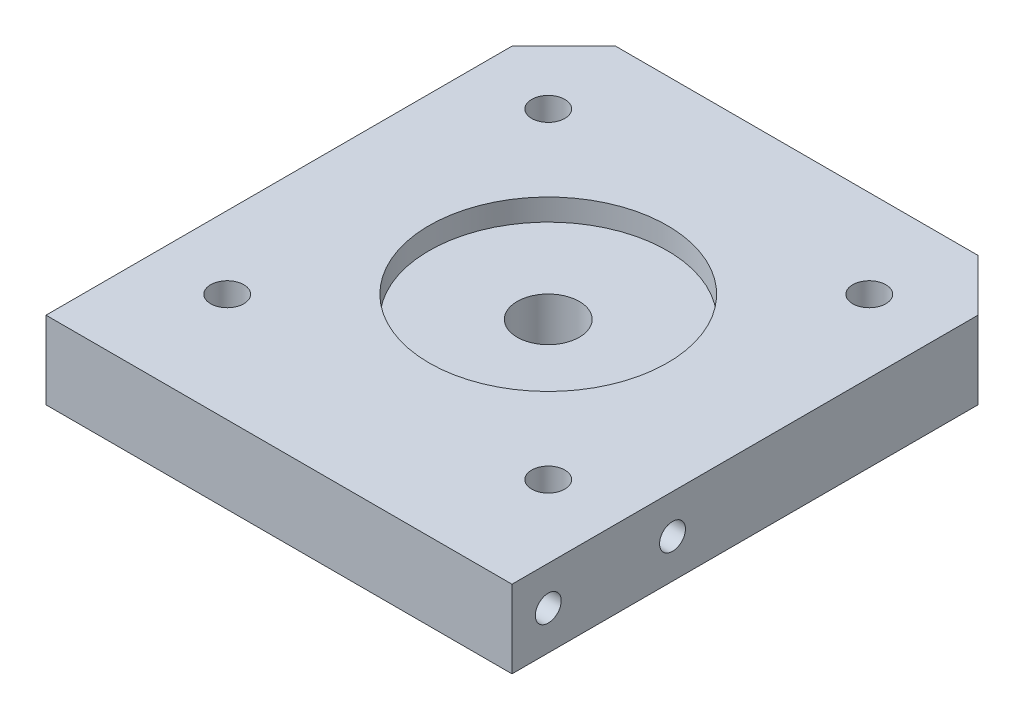
ISO-10303-21;
HEADER;
FILE_DESCRIPTION(('STEP AP214'),'2;1');
FILE_NAME('part.step','',(''),(''),'','','');
FILE_SCHEMA(('AUTOMOTIVE_DESIGN { 1 0 10303 214 1 1 1 1 }'));
ENDSEC;
DATA;
#1=APPLICATION_CONTEXT('core data for automotive mechanical design processes');
#2=APPLICATION_PROTOCOL_DEFINITION('international standard','automotive_design',2000,#1);
#3=PRODUCT_CONTEXT('',#1,'mechanical');
#4=PRODUCT('Part','Part','',(#3));
#5=PRODUCT_RELATED_PRODUCT_CATEGORY('part','',(#4));
#6=PRODUCT_DEFINITION_FORMATION('','',#4);
#7=PRODUCT_DEFINITION_CONTEXT('part definition',#1,'design');
#8=PRODUCT_DEFINITION('design','',#6,#7);
#9=PRODUCT_DEFINITION_SHAPE('','',#8);
#10=(LENGTH_UNIT() NAMED_UNIT(*) SI_UNIT(.MILLI.,.METRE.));
#11=(NAMED_UNIT(*) PLANE_ANGLE_UNIT() SI_UNIT($,.RADIAN.));
#12=(NAMED_UNIT(*) SI_UNIT($,.STERADIAN.) SOLID_ANGLE_UNIT());
#13=UNCERTAINTY_MEASURE_WITH_UNIT(LENGTH_MEASURE(1.E-05),#10,'distance_accuracy_value','');
#14=(GEOMETRIC_REPRESENTATION_CONTEXT(3) GLOBAL_UNCERTAINTY_ASSIGNED_CONTEXT((#13)) GLOBAL_UNIT_ASSIGNED_CONTEXT((#10,
#11,#12)) REPRESENTATION_CONTEXT('',''));
#15=CARTESIAN_POINT('',(0.,0.,0.));
#16=DIRECTION('',(0.,0.,1.));
#17=DIRECTION('',(1.,0.,0.));
#18=AXIS2_PLACEMENT_3D('',#15,#16,#17);
#19=CARTESIAN_POINT('',(0.,7.5,1.5));
#20=DIRECTION('',(0.,-1.,0.));
#21=DIRECTION('',(0.,0.,-1.));
#22=AXIS2_PLACEMENT_3D('',#19,#20,#21);
#23=CYLINDRICAL_SURFACE('',#22,3.);
#24=CARTESIAN_POINT('',(0.,0.,1.5));
#25=DIRECTION('',(0.,1.,0.));
#26=DIRECTION('',(0.,0.,1.));
#27=AXIS2_PLACEMENT_3D('',#24,#25,#26);
#28=CIRCLE('',#27,3.);
#29=CARTESIAN_POINT('',(0.,0.,4.5));
#30=VERTEX_POINT('',#29);
#31=EDGE_CURVE('E207',#30,#30,#28,.T.);
#32=ORIENTED_EDGE('',*,*,#31,.F.);
#33=EDGE_LOOP('',(#32));
#34=FACE_BOUND('',#33,.T.);
#35=CARTESIAN_POINT('',(0.,5.4,1.5));
#36=DIRECTION('',(0.,1.,0.));
#37=DIRECTION('',(0.,0.,1.));
#38=AXIS2_PLACEMENT_3D('',#35,#36,#37);
#39=CIRCLE('',#38,3.);
#40=CARTESIAN_POINT('',(0.,5.4,4.5));
#41=VERTEX_POINT('',#40);
#42=EDGE_CURVE('E204',#41,#41,#39,.T.);
#43=ORIENTED_EDGE('',*,*,#42,.T.);
#44=EDGE_LOOP('',(#43));
#45=FACE_BOUND('',#44,.T.);
#46=ADVANCED_FACE('F42',(#34,#45),#23,.F.);
#47=CARTESIAN_POINT('',(0.,7.5,0.));
#48=DIRECTION('',(0.,-1.,0.));
#49=DIRECTION('',(0.,0.,-1.));
#50=AXIS2_PLACEMENT_3D('',#47,#48,#49);
#51=PLANE('',#50);
#52=CARTESIAN_POINT('',(-15.5,7.5,-14.));
#53=DIRECTION('',(0.,-1.,0.));
#54=DIRECTION('',(0.,0.,-1.));
#55=AXIS2_PLACEMENT_3D('',#52,#53,#54);
#56=CIRCLE('',#55,1.6);
#57=CARTESIAN_POINT('',(-15.5,7.5,-15.6));
#58=VERTEX_POINT('',#57);
#59=EDGE_CURVE('E161',#58,#58,#56,.T.);
#60=ORIENTED_EDGE('',*,*,#59,.T.);
#61=EDGE_LOOP('',(#60));
#62=FACE_BOUND('',#61,.T.);
#63=CARTESIAN_POINT('',(15.5,7.5,17.));
#64=DIRECTION('',(0.,-1.,0.));
#65=DIRECTION('',(0.,0.,-1.));
#66=AXIS2_PLACEMENT_3D('',#63,#64,#65);
#67=CIRCLE('',#66,1.6);
#68=CARTESIAN_POINT('',(15.5,7.5,15.4));
#69=VERTEX_POINT('',#68);
#70=EDGE_CURVE('E173',#69,#69,#67,.T.);
#71=ORIENTED_EDGE('',*,*,#70,.T.);
#72=EDGE_LOOP('',(#71));
#73=FACE_BOUND('',#72,.T.);
#74=CARTESIAN_POINT('',(15.5,7.5,-14.));
#75=DIRECTION('',(0.,-1.,0.));
#76=DIRECTION('',(0.,0.,-1.));
#77=AXIS2_PLACEMENT_3D('',#74,#75,#76);
#78=CIRCLE('',#77,1.6);
#79=CARTESIAN_POINT('',(15.5,7.5,-15.6));
#80=VERTEX_POINT('',#79);
#81=EDGE_CURVE('E185',#80,#80,#78,.T.);
#82=ORIENTED_EDGE('',*,*,#81,.T.);
#83=EDGE_LOOP('',(#82));
#84=FACE_BOUND('',#83,.T.);
#85=CARTESIAN_POINT('',(-15.5,7.5,17.));
#86=DIRECTION('',(0.,-1.,0.));
#87=DIRECTION('',(0.,0.,-1.));
#88=AXIS2_PLACEMENT_3D('',#85,#86,#87);
#89=CIRCLE('',#88,1.6);
#90=CARTESIAN_POINT('',(-15.5,7.5,15.4));
#91=VERTEX_POINT('',#90);
#92=EDGE_CURVE('E197',#91,#91,#89,.T.);
#93=ORIENTED_EDGE('',*,*,#92,.T.);
#94=EDGE_LOOP('',(#93));
#95=FACE_BOUND('',#94,.T.);
#96=CARTESIAN_POINT('',(0.,7.5,1.5));
#97=DIRECTION('',(0.,1.,0.));
#98=DIRECTION('',(0.,0.,1.));
#99=AXIS2_PLACEMENT_3D('',#96,#97,#98);
#100=CIRCLE('',#99,11.5);
#101=CARTESIAN_POINT('',(0.,7.5,13.));
#102=VERTEX_POINT('',#101);
#103=EDGE_CURVE('E200',#102,#102,#100,.T.);
#104=ORIENTED_EDGE('',*,*,#103,.F.);
#105=EDGE_LOOP('',(#104));
#106=FACE_BOUND('',#105,.T.);
#107=DIRECTION('',(0.,0.,-1.));
#108=VECTOR('',#107,1.);
#109=CARTESIAN_POINT('',(22.5,7.5,22.5));
#110=LINE('',#109,#108);
#111=CARTESIAN_POINT('',(22.5,7.5,27.5));
#112=VERTEX_POINT('',#111);
#113=CARTESIAN_POINT('',(22.5,7.5,-17.5));
#114=VERTEX_POINT('',#113);
#115=EDGE_CURVE('E211',#112,#114,#110,.T.);
#116=ORIENTED_EDGE('',*,*,#115,.T.);
#117=DIRECTION('',(0.707106781186547,0.,0.707106781186549));
#118=VECTOR('',#117,1.);
#119=CARTESIAN_POINT('',(17.5,7.5,-22.5));
#120=LINE('',#119,#118);
#121=CARTESIAN_POINT('',(17.5,7.5,-22.5));
#122=VERTEX_POINT('',#121);
#123=EDGE_CURVE('E50',#114,#122,#120,.F.);
#124=ORIENTED_EDGE('',*,*,#123,.T.);
#125=DIRECTION('',(-1.,0.,0.));
#126=VECTOR('',#125,1.);
#127=CARTESIAN_POINT('',(-22.5,7.5,-22.5));
#128=LINE('',#127,#126);
#129=CARTESIAN_POINT('',(-17.5,7.5,-22.5));
#130=VERTEX_POINT('',#129);
#131=EDGE_CURVE('E213',#122,#130,#128,.T.);
#132=ORIENTED_EDGE('',*,*,#131,.T.);
#133=DIRECTION('',(0.707106781186548,0.,-0.707106781186547));
#134=VECTOR('',#133,1.);
#135=CARTESIAN_POINT('',(-22.5,7.5,-17.5));
#136=LINE('',#135,#134);
#137=CARTESIAN_POINT('',(-22.5,7.5,-17.5));
#138=VERTEX_POINT('',#137);
#139=EDGE_CURVE('E57',#130,#138,#136,.F.);
#140=ORIENTED_EDGE('',*,*,#139,.T.);
#141=DIRECTION('',(0.,0.,1.));
#142=VECTOR('',#141,1.);
#143=CARTESIAN_POINT('',(-22.5,7.5,22.5));
#144=LINE('',#143,#142);
#145=CARTESIAN_POINT('',(-22.5,7.5,27.5));
#146=VERTEX_POINT('',#145);
#147=EDGE_CURVE('E216',#138,#146,#144,.T.);
#148=ORIENTED_EDGE('',*,*,#147,.T.);
#149=DIRECTION('',(-1.,0.,0.));
#150=VECTOR('',#149,1.);
#151=CARTESIAN_POINT('',(-22.5,7.5,27.5));
#152=LINE('',#151,#150);
#153=EDGE_CURVE('E149',#112,#146,#152,.T.);
#154=ORIENTED_EDGE('',*,*,#153,.F.);
#155=EDGE_LOOP('',(#116,#124,#132,#140,#148,#154));
#156=FACE_BOUND('',#155,.T.);
#157=ADVANCED_FACE('F237',(#62,#73,#84,#95,#106,#156),#51,.F.);
#158=CARTESIAN_POINT('',(0.,0.,0.));
#159=DIRECTION('',(0.,-1.,0.));
#160=DIRECTION('',(0.,0.,-1.));
#161=AXIS2_PLACEMENT_3D('',#158,#159,#160);
#162=PLANE('',#161);
#163=CARTESIAN_POINT('',(-15.5,0.,-14.));
#164=DIRECTION('',(0.,-1.,0.));
#165=DIRECTION('',(0.,0.,-1.));
#166=AXIS2_PLACEMENT_3D('',#163,#164,#165);
#167=CIRCLE('',#166,3.25);
#168=CARTESIAN_POINT('',(-15.5,0.,-17.25));
#169=VERTEX_POINT('',#168);
#170=EDGE_CURVE('E152',#169,#169,#167,.T.);
#171=ORIENTED_EDGE('',*,*,#170,.F.);
#172=EDGE_LOOP('',(#171));
#173=FACE_BOUND('',#172,.T.);
#174=CARTESIAN_POINT('',(15.5,0.,17.));
#175=DIRECTION('',(0.,-1.,0.));
#176=DIRECTION('',(0.,0.,-1.));
#177=AXIS2_PLACEMENT_3D('',#174,#175,#176);
#178=CIRCLE('',#177,3.25);
#179=CARTESIAN_POINT('',(15.5,0.,13.75));
#180=VERTEX_POINT('',#179);
#181=EDGE_CURVE('E164',#180,#180,#178,.T.);
#182=ORIENTED_EDGE('',*,*,#181,.F.);
#183=EDGE_LOOP('',(#182));
#184=FACE_BOUND('',#183,.T.);
#185=CARTESIAN_POINT('',(15.5,0.,-14.));
#186=DIRECTION('',(0.,-1.,0.));
#187=DIRECTION('',(0.,0.,-1.));
#188=AXIS2_PLACEMENT_3D('',#185,#186,#187);
#189=CIRCLE('',#188,3.25);
#190=CARTESIAN_POINT('',(15.5,0.,-17.25));
#191=VERTEX_POINT('',#190);
#192=EDGE_CURVE('E176',#191,#191,#189,.T.);
#193=ORIENTED_EDGE('',*,*,#192,.F.);
#194=EDGE_LOOP('',(#193));
#195=FACE_BOUND('',#194,.T.);
#196=CARTESIAN_POINT('',(-15.5,0.,17.));
#197=DIRECTION('',(0.,-1.,0.));
#198=DIRECTION('',(0.,0.,-1.));
#199=AXIS2_PLACEMENT_3D('',#196,#197,#198);
#200=CIRCLE('',#199,3.25);
#201=CARTESIAN_POINT('',(-15.5,0.,13.75));
#202=VERTEX_POINT('',#201);
#203=EDGE_CURVE('E188',#202,#202,#200,.T.);
#204=ORIENTED_EDGE('',*,*,#203,.F.);
#205=EDGE_LOOP('',(#204));
#206=FACE_BOUND('',#205,.T.);
#207=DIRECTION('',(-1.,0.,0.));
#208=VECTOR('',#207,1.);
#209=CARTESIAN_POINT('',(-22.5,0.,-22.5));
#210=LINE('',#209,#208);
#211=CARTESIAN_POINT('',(17.5,0.,-22.5));
#212=VERTEX_POINT('',#211);
#213=CARTESIAN_POINT('',(-17.5,0.,-22.5));
#214=VERTEX_POINT('',#213);
#215=EDGE_CURVE('E220',#212,#214,#210,.T.);
#216=ORIENTED_EDGE('',*,*,#215,.F.);
#217=DIRECTION('',(-0.707106781186547,0.,-0.707106781186549));
#218=VECTOR('',#217,1.);
#219=CARTESIAN_POINT('',(20.,0.,-20.));
#220=LINE('',#219,#218);
#221=CARTESIAN_POINT('',(22.5,0.,-17.5));
#222=VERTEX_POINT('',#221);
#223=EDGE_CURVE('E232',#212,#222,#220,.F.);
#224=ORIENTED_EDGE('',*,*,#223,.T.);
#225=DIRECTION('',(0.,0.,-1.));
#226=VECTOR('',#225,1.);
#227=CARTESIAN_POINT('',(22.5,0.,22.5));
#228=LINE('',#227,#226);
#229=CARTESIAN_POINT('',(22.5,0.,27.5));
#230=VERTEX_POINT('',#229);
#231=EDGE_CURVE('E210',#230,#222,#228,.T.);
#232=ORIENTED_EDGE('',*,*,#231,.F.);
#233=DIRECTION('',(1.,0.,0.));
#234=VECTOR('',#233,1.);
#235=CARTESIAN_POINT('',(-22.5,0.,27.5));
#236=LINE('',#235,#234);
#237=CARTESIAN_POINT('',(-22.5,0.,27.5));
#238=VERTEX_POINT('',#237);
#239=EDGE_CURVE('E143',#238,#230,#236,.T.);
#240=ORIENTED_EDGE('',*,*,#239,.F.);
#241=DIRECTION('',(0.,0.,1.));
#242=VECTOR('',#241,1.);
#243=CARTESIAN_POINT('',(-22.5,0.,22.5));
#244=LINE('',#243,#242);
#245=CARTESIAN_POINT('',(-22.5,0.,-17.5));
#246=VERTEX_POINT('',#245);
#247=EDGE_CURVE('E214',#246,#238,#244,.T.);
#248=ORIENTED_EDGE('',*,*,#247,.F.);
#249=DIRECTION('',(-0.707106781186548,0.,0.707106781186547));
#250=VECTOR('',#249,1.);
#251=CARTESIAN_POINT('',(-20.,0.,-20.));
#252=LINE('',#251,#250);
#253=EDGE_CURVE('E230',#246,#214,#252,.F.);
#254=ORIENTED_EDGE('',*,*,#253,.T.);
#255=EDGE_LOOP('',(#216,#224,#232,#240,#248,#254));
#256=FACE_BOUND('',#255,.T.);
#257=ORIENTED_EDGE('',*,*,#31,.T.);
#258=EDGE_LOOP('',(#257));
#259=FACE_BOUND('',#258,.T.);
#260=ADVANCED_FACE('F247',(#173,#184,#195,#206,#256,#259),#162,.T.);
#261=CARTESIAN_POINT('',(22.5,7.5,22.5));
#262=DIRECTION('',(-1.,0.,0.));
#263=DIRECTION('',(0.,0.,1.));
#264=AXIS2_PLACEMENT_3D('',#261,#262,#263);
#265=PLANE('',#264);
#266=CARTESIAN_POINT('',(22.5,3.75,24.));
#267=DIRECTION('',(1.,0.,0.));
#268=DIRECTION('',(0.,0.,-1.));
#269=AXIS2_PLACEMENT_3D('',#266,#267,#268);
#270=CIRCLE('',#269,1.24999999999999);
#271=CARTESIAN_POINT('',(22.5,3.75,22.75));
#272=VERTEX_POINT('',#271);
#273=EDGE_CURVE('E118',#272,#272,#270,.T.);
#274=ORIENTED_EDGE('',*,*,#273,.F.);
#275=EDGE_LOOP('',(#274));
#276=FACE_BOUND('',#275,.T.);
#277=CARTESIAN_POINT('',(22.5,3.75,12.));
#278=DIRECTION('',(1.,0.,0.));
#279=DIRECTION('',(0.,0.,-1.));
#280=AXIS2_PLACEMENT_3D('',#277,#278,#279);
#281=CIRCLE('',#280,1.24999999999999);
#282=CARTESIAN_POINT('',(22.5,3.75,10.75));
#283=VERTEX_POINT('',#282);
#284=EDGE_CURVE('E117',#283,#283,#281,.T.);
#285=ORIENTED_EDGE('',*,*,#284,.F.);
#286=EDGE_LOOP('',(#285));
#287=FACE_BOUND('',#286,.T.);
#288=ORIENTED_EDGE('',*,*,#231,.T.);
#289=DIRECTION('',(0.,1.,0.));
#290=VECTOR('',#289,1.);
#291=CARTESIAN_POINT('',(22.5,7.5,-17.5));
#292=LINE('',#291,#290);
#293=EDGE_CURVE('E65',#222,#114,#292,.T.);
#294=ORIENTED_EDGE('',*,*,#293,.T.);
#295=ORIENTED_EDGE('',*,*,#115,.F.);
#296=DIRECTION('',(0.,1.,0.));
#297=VECTOR('',#296,1.);
#298=CARTESIAN_POINT('',(22.5,7.5,27.5));
#299=LINE('',#298,#297);
#300=EDGE_CURVE('E146',#230,#112,#299,.T.);
#301=ORIENTED_EDGE('',*,*,#300,.F.);
#302=EDGE_LOOP('',(#288,#294,#295,#301));
#303=FACE_BOUND('',#302,.T.);
#304=ADVANCED_FACE('F251',(#276,#287,#303),#265,.F.);
#305=CARTESIAN_POINT('',(-22.5,7.5,-22.5));
#306=DIRECTION('',(0.,0.,1.));
#307=DIRECTION('',(1.,0.,0.));
#308=AXIS2_PLACEMENT_3D('',#305,#306,#307);
#309=PLANE('',#308);
#310=ORIENTED_EDGE('',*,*,#131,.F.);
#311=DIRECTION('',(0.,-1.,0.));
#312=VECTOR('',#311,1.);
#313=CARTESIAN_POINT('',(17.5,7.5,-22.5));
#314=LINE('',#313,#312);
#315=EDGE_CURVE('E227',#122,#212,#314,.T.);
#316=ORIENTED_EDGE('',*,*,#315,.T.);
#317=ORIENTED_EDGE('',*,*,#215,.T.);
#318=DIRECTION('',(0.,1.,0.));
#319=VECTOR('',#318,1.);
#320=CARTESIAN_POINT('',(-17.5,7.5,-22.5));
#321=LINE('',#320,#319);
#322=EDGE_CURVE('E218',#214,#130,#321,.T.);
#323=ORIENTED_EDGE('',*,*,#322,.T.);
#324=EDGE_LOOP('',(#310,#316,#317,#323));
#325=FACE_BOUND('',#324,.T.);
#326=ADVANCED_FACE('F242',(#325),#309,.F.);
#327=CARTESIAN_POINT('',(-22.5,7.5,22.5));
#328=DIRECTION('',(1.,0.,0.));
#329=DIRECTION('',(0.,0.,-1.));
#330=AXIS2_PLACEMENT_3D('',#327,#328,#329);
#331=PLANE('',#330);
#332=CARTESIAN_POINT('',(-22.5,3.75,24.));
#333=DIRECTION('',(-1.,0.,0.));
#334=DIRECTION('',(0.,0.,1.));
#335=AXIS2_PLACEMENT_3D('',#332,#333,#334);
#336=CIRCLE('',#335,1.24999999999999);
#337=CARTESIAN_POINT('',(-22.5,3.75,25.25));
#338=VERTEX_POINT('',#337);
#339=EDGE_CURVE('E128',#338,#338,#336,.T.);
#340=ORIENTED_EDGE('',*,*,#339,.F.);
#341=EDGE_LOOP('',(#340));
#342=FACE_BOUND('',#341,.T.);
#343=CARTESIAN_POINT('',(-22.5,3.75,12.));
#344=DIRECTION('',(-1.,0.,0.));
#345=DIRECTION('',(0.,0.,1.));
#346=AXIS2_PLACEMENT_3D('',#343,#344,#345);
#347=CIRCLE('',#346,1.24999999999999);
#348=CARTESIAN_POINT('',(-22.5,3.75,13.25));
#349=VERTEX_POINT('',#348);
#350=EDGE_CURVE('E134',#349,#349,#347,.T.);
#351=ORIENTED_EDGE('',*,*,#350,.F.);
#352=EDGE_LOOP('',(#351));
#353=FACE_BOUND('',#352,.T.);
#354=ORIENTED_EDGE('',*,*,#147,.F.);
#355=DIRECTION('',(0.,-1.,0.));
#356=VECTOR('',#355,1.);
#357=CARTESIAN_POINT('',(-22.5,7.5,-17.5));
#358=LINE('',#357,#356);
#359=EDGE_CURVE('E11',#138,#246,#358,.T.);
#360=ORIENTED_EDGE('',*,*,#359,.T.);
#361=ORIENTED_EDGE('',*,*,#247,.T.);
#362=DIRECTION('',(0.,-1.,0.));
#363=VECTOR('',#362,1.);
#364=CARTESIAN_POINT('',(-22.5,7.5,27.5));
#365=LINE('',#364,#363);
#366=EDGE_CURVE('E140',#146,#238,#365,.T.);
#367=ORIENTED_EDGE('',*,*,#366,.F.);
#368=EDGE_LOOP('',(#354,#360,#361,#367));
#369=FACE_BOUND('',#368,.T.);
#370=ADVANCED_FACE('F257',(#342,#353,#369),#331,.F.);
#371=CARTESIAN_POINT('',(0.,5.4,1.5));
#372=DIRECTION('',(0.,1.,0.));
#373=DIRECTION('',(0.,0.,1.));
#374=AXIS2_PLACEMENT_3D('',#371,#372,#373);
#375=CYLINDRICAL_SURFACE('',#374,11.5);
#376=CARTESIAN_POINT('',(0.,5.4,1.5));
#377=DIRECTION('',(0.,1.,0.));
#378=DIRECTION('',(0.,0.,1.));
#379=AXIS2_PLACEMENT_3D('',#376,#377,#378);
#380=CIRCLE('',#379,11.5);
#381=CARTESIAN_POINT('',(0.,5.4,13.));
#382=VERTEX_POINT('',#381);
#383=EDGE_CURVE('E201',#382,#382,#380,.T.);
#384=ORIENTED_EDGE('',*,*,#383,.F.);
#385=EDGE_LOOP('',(#384));
#386=FACE_BOUND('',#385,.T.);
#387=ORIENTED_EDGE('',*,*,#103,.T.);
#388=EDGE_LOOP('',(#387));
#389=FACE_BOUND('',#388,.T.);
#390=ADVANCED_FACE('F281',(#386,#389),#375,.F.);
#391=CARTESIAN_POINT('',(0.,5.4,1.5));
#392=DIRECTION('',(0.,1.,0.));
#393=DIRECTION('',(0.,0.,1.));
#394=AXIS2_PLACEMENT_3D('',#391,#392,#393);
#395=PLANE('',#394);
#396=ORIENTED_EDGE('',*,*,#42,.F.);
#397=EDGE_LOOP('',(#396));
#398=FACE_BOUND('',#397,.T.);
#399=ORIENTED_EDGE('',*,*,#383,.T.);
#400=EDGE_LOOP('',(#399));
#401=FACE_BOUND('',#400,.T.);
#402=ADVANCED_FACE('F269',(#398,#401),#395,.T.);
#403=CARTESIAN_POINT('',(17.5,7.5,-22.5));
#404=DIRECTION('',(-0.707106781186549,0.,0.707106781186547));
#405=DIRECTION('',(0.,-1.,0.));
#406=AXIS2_PLACEMENT_3D('',#403,#404,#405);
#407=PLANE('',#406);
#408=ORIENTED_EDGE('',*,*,#123,.F.);
#409=ORIENTED_EDGE('',*,*,#293,.F.);
#410=ORIENTED_EDGE('',*,*,#223,.F.);
#411=ORIENTED_EDGE('',*,*,#315,.F.);
#412=EDGE_LOOP('',(#408,#409,#410,#411));
#413=FACE_BOUND('',#412,.T.);
#414=ADVANCED_FACE('F245',(#413),#407,.F.);
#415=CARTESIAN_POINT('',(-22.5,7.5,-17.5));
#416=DIRECTION('',(0.707106781186547,0.,0.707106781186548));
#417=DIRECTION('',(0.,-1.,0.));
#418=AXIS2_PLACEMENT_3D('',#415,#416,#417);
#419=PLANE('',#418);
#420=ORIENTED_EDGE('',*,*,#139,.F.);
#421=ORIENTED_EDGE('',*,*,#322,.F.);
#422=ORIENTED_EDGE('',*,*,#253,.F.);
#423=ORIENTED_EDGE('',*,*,#359,.F.);
#424=EDGE_LOOP('',(#420,#421,#422,#423));
#425=FACE_BOUND('',#424,.T.);
#426=ADVANCED_FACE('F44',(#425),#419,.F.);
#427=CARTESIAN_POINT('',(-15.5,0.,17.));
#428=DIRECTION('',(0.,-1.,0.));
#429=DIRECTION('',(0.,0.,-1.));
#430=AXIS2_PLACEMENT_3D('',#427,#428,#429);
#431=CYLINDRICAL_SURFACE('',#430,1.6);
#432=ORIENTED_EDGE('',*,*,#92,.F.);
#433=EDGE_LOOP('',(#432));
#434=FACE_BOUND('',#433,.T.);
#435=CARTESIAN_POINT('',(-15.5,3.5,17.));
#436=DIRECTION('',(0.,-1.,0.));
#437=DIRECTION('',(0.,0.,-1.));
#438=AXIS2_PLACEMENT_3D('',#435,#436,#437);
#439=CIRCLE('',#438,1.6);
#440=CARTESIAN_POINT('',(-15.5,3.5,15.4));
#441=VERTEX_POINT('',#440);
#442=EDGE_CURVE('E194',#441,#441,#439,.T.);
#443=ORIENTED_EDGE('',*,*,#442,.T.);
#444=EDGE_LOOP('',(#443));
#445=FACE_BOUND('',#444,.T.);
#446=ADVANCED_FACE('F261',(#434,#445),#431,.F.);
#447=CARTESIAN_POINT('',(-13.9,3.5,17.));
#448=DIRECTION('',(0.,1.,0.));
#449=DIRECTION('',(0.,0.,1.));
#450=AXIS2_PLACEMENT_3D('',#447,#448,#449);
#451=PLANE('',#450);
#452=ORIENTED_EDGE('',*,*,#442,.F.);
#453=EDGE_LOOP('',(#452));
#454=FACE_BOUND('',#453,.T.);
#455=CARTESIAN_POINT('',(-15.5,3.5,17.));
#456=DIRECTION('',(0.,-1.,0.));
#457=DIRECTION('',(0.,0.,-1.));
#458=AXIS2_PLACEMENT_3D('',#455,#456,#457);
#459=CIRCLE('',#458,3.25);
#460=CARTESIAN_POINT('',(-15.5,3.5,13.75));
#461=VERTEX_POINT('',#460);
#462=EDGE_CURVE('E191',#461,#461,#459,.T.);
#463=ORIENTED_EDGE('',*,*,#462,.T.);
#464=EDGE_LOOP('',(#463));
#465=FACE_BOUND('',#464,.T.);
#466=ADVANCED_FACE('F266',(#454,#465),#451,.F.);
#467=CARTESIAN_POINT('',(-15.5,0.,17.));
#468=DIRECTION('',(0.,-1.,0.));
#469=DIRECTION('',(0.,0.,-1.));
#470=AXIS2_PLACEMENT_3D('',#467,#468,#469);
#471=CYLINDRICAL_SURFACE('',#470,3.25);
#472=ORIENTED_EDGE('',*,*,#462,.F.);
#473=EDGE_LOOP('',(#472));
#474=FACE_BOUND('',#473,.T.);
#475=ORIENTED_EDGE('',*,*,#203,.T.);
#476=EDGE_LOOP('',(#475));
#477=FACE_BOUND('',#476,.T.);
#478=ADVANCED_FACE('F365',(#474,#477),#471,.F.);
#479=CARTESIAN_POINT('',(15.5,0.,-14.));
#480=DIRECTION('',(0.,-1.,0.));
#481=DIRECTION('',(0.,0.,-1.));
#482=AXIS2_PLACEMENT_3D('',#479,#480,#481);
#483=CYLINDRICAL_SURFACE('',#482,1.6);
#484=ORIENTED_EDGE('',*,*,#81,.F.);
#485=EDGE_LOOP('',(#484));
#486=FACE_BOUND('',#485,.T.);
#487=CARTESIAN_POINT('',(15.5,3.5,-14.));
#488=DIRECTION('',(0.,-1.,0.));
#489=DIRECTION('',(0.,0.,-1.));
#490=AXIS2_PLACEMENT_3D('',#487,#488,#489);
#491=CIRCLE('',#490,1.6);
#492=CARTESIAN_POINT('',(15.5,3.5,-15.6));
#493=VERTEX_POINT('',#492);
#494=EDGE_CURVE('E182',#493,#493,#491,.T.);
#495=ORIENTED_EDGE('',*,*,#494,.T.);
#496=EDGE_LOOP('',(#495));
#497=FACE_BOUND('',#496,.T.);
#498=ADVANCED_FACE('F361',(#486,#497),#483,.F.);
#499=CARTESIAN_POINT('',(17.1,3.5,-14.));
#500=DIRECTION('',(0.,1.,0.));
#501=DIRECTION('',(0.,0.,1.));
#502=AXIS2_PLACEMENT_3D('',#499,#500,#501);
#503=PLANE('',#502);
#504=ORIENTED_EDGE('',*,*,#494,.F.);
#505=EDGE_LOOP('',(#504));
#506=FACE_BOUND('',#505,.T.);
#507=CARTESIAN_POINT('',(15.5,3.5,-14.));
#508=DIRECTION('',(0.,-1.,0.));
#509=DIRECTION('',(0.,0.,-1.));
#510=AXIS2_PLACEMENT_3D('',#507,#508,#509);
#511=CIRCLE('',#510,3.25);
#512=CARTESIAN_POINT('',(15.5,3.5,-17.25));
#513=VERTEX_POINT('',#512);
#514=EDGE_CURVE('E179',#513,#513,#511,.T.);
#515=ORIENTED_EDGE('',*,*,#514,.T.);
#516=EDGE_LOOP('',(#515));
#517=FACE_BOUND('',#516,.T.);
#518=ADVANCED_FACE('F357',(#506,#517),#503,.F.);
#519=CARTESIAN_POINT('',(15.5,0.,-14.));
#520=DIRECTION('',(0.,-1.,0.));
#521=DIRECTION('',(0.,0.,-1.));
#522=AXIS2_PLACEMENT_3D('',#519,#520,#521);
#523=CYLINDRICAL_SURFACE('',#522,3.25);
#524=ORIENTED_EDGE('',*,*,#514,.F.);
#525=EDGE_LOOP('',(#524));
#526=FACE_BOUND('',#525,.T.);
#527=ORIENTED_EDGE('',*,*,#192,.T.);
#528=EDGE_LOOP('',(#527));
#529=FACE_BOUND('',#528,.T.);
#530=ADVANCED_FACE('F353',(#526,#529),#523,.F.);
#531=CARTESIAN_POINT('',(15.5,0.,17.));
#532=DIRECTION('',(0.,-1.,0.));
#533=DIRECTION('',(0.,0.,-1.));
#534=AXIS2_PLACEMENT_3D('',#531,#532,#533);
#535=CYLINDRICAL_SURFACE('',#534,1.6);
#536=ORIENTED_EDGE('',*,*,#70,.F.);
#537=EDGE_LOOP('',(#536));
#538=FACE_BOUND('',#537,.T.);
#539=CARTESIAN_POINT('',(15.5,3.5,17.));
#540=DIRECTION('',(0.,-1.,0.));
#541=DIRECTION('',(0.,0.,-1.));
#542=AXIS2_PLACEMENT_3D('',#539,#540,#541);
#543=CIRCLE('',#542,1.6);
#544=CARTESIAN_POINT('',(15.5,3.5,15.4));
#545=VERTEX_POINT('',#544);
#546=EDGE_CURVE('E170',#545,#545,#543,.T.);
#547=ORIENTED_EDGE('',*,*,#546,.T.);
#548=EDGE_LOOP('',(#547));
#549=FACE_BOUND('',#548,.T.);
#550=ADVANCED_FACE('F349',(#538,#549),#535,.F.);
#551=CARTESIAN_POINT('',(17.1,3.5,17.));
#552=DIRECTION('',(0.,1.,0.));
#553=DIRECTION('',(0.,0.,1.));
#554=AXIS2_PLACEMENT_3D('',#551,#552,#553);
#555=PLANE('',#554);
#556=ORIENTED_EDGE('',*,*,#546,.F.);
#557=EDGE_LOOP('',(#556));
#558=FACE_BOUND('',#557,.T.);
#559=CARTESIAN_POINT('',(15.5,3.5,17.));
#560=DIRECTION('',(0.,-1.,0.));
#561=DIRECTION('',(0.,0.,-1.));
#562=AXIS2_PLACEMENT_3D('',#559,#560,#561);
#563=CIRCLE('',#562,3.25);
#564=CARTESIAN_POINT('',(15.5,3.5,13.75));
#565=VERTEX_POINT('',#564);
#566=EDGE_CURVE('E167',#565,#565,#563,.T.);
#567=ORIENTED_EDGE('',*,*,#566,.T.);
#568=EDGE_LOOP('',(#567));
#569=FACE_BOUND('',#568,.T.);
#570=ADVANCED_FACE('F345',(#558,#569),#555,.F.);
#571=CARTESIAN_POINT('',(15.5,0.,17.));
#572=DIRECTION('',(0.,-1.,0.));
#573=DIRECTION('',(0.,0.,-1.));
#574=AXIS2_PLACEMENT_3D('',#571,#572,#573);
#575=CYLINDRICAL_SURFACE('',#574,3.25);
#576=ORIENTED_EDGE('',*,*,#566,.F.);
#577=EDGE_LOOP('',(#576));
#578=FACE_BOUND('',#577,.T.);
#579=ORIENTED_EDGE('',*,*,#181,.T.);
#580=EDGE_LOOP('',(#579));
#581=FACE_BOUND('',#580,.T.);
#582=ADVANCED_FACE('F341',(#578,#581),#575,.F.);
#583=CARTESIAN_POINT('',(-15.5,0.,-14.));
#584=DIRECTION('',(0.,-1.,0.));
#585=DIRECTION('',(0.,0.,-1.));
#586=AXIS2_PLACEMENT_3D('',#583,#584,#585);
#587=CYLINDRICAL_SURFACE('',#586,1.6);
#588=ORIENTED_EDGE('',*,*,#59,.F.);
#589=EDGE_LOOP('',(#588));
#590=FACE_BOUND('',#589,.T.);
#591=CARTESIAN_POINT('',(-15.5,3.5,-14.));
#592=DIRECTION('',(0.,-1.,0.));
#593=DIRECTION('',(0.,0.,-1.));
#594=AXIS2_PLACEMENT_3D('',#591,#592,#593);
#595=CIRCLE('',#594,1.6);
#596=CARTESIAN_POINT('',(-15.5,3.5,-15.6));
#597=VERTEX_POINT('',#596);
#598=EDGE_CURVE('E158',#597,#597,#595,.T.);
#599=ORIENTED_EDGE('',*,*,#598,.T.);
#600=EDGE_LOOP('',(#599));
#601=FACE_BOUND('',#600,.T.);
#602=ADVANCED_FACE('F337',(#590,#601),#587,.F.);
#603=CARTESIAN_POINT('',(-13.9,3.5,-14.));
#604=DIRECTION('',(0.,1.,0.));
#605=DIRECTION('',(0.,0.,1.));
#606=AXIS2_PLACEMENT_3D('',#603,#604,#605);
#607=PLANE('',#606);
#608=ORIENTED_EDGE('',*,*,#598,.F.);
#609=EDGE_LOOP('',(#608));
#610=FACE_BOUND('',#609,.T.);
#611=CARTESIAN_POINT('',(-15.5,3.5,-14.));
#612=DIRECTION('',(0.,-1.,0.));
#613=DIRECTION('',(0.,0.,-1.));
#614=AXIS2_PLACEMENT_3D('',#611,#612,#613);
#615=CIRCLE('',#614,3.25);
#616=CARTESIAN_POINT('',(-15.5,3.5,-17.25));
#617=VERTEX_POINT('',#616);
#618=EDGE_CURVE('E155',#617,#617,#615,.T.);
#619=ORIENTED_EDGE('',*,*,#618,.T.);
#620=EDGE_LOOP('',(#619));
#621=FACE_BOUND('',#620,.T.);
#622=ADVANCED_FACE('F333',(#610,#621),#607,.F.);
#623=CARTESIAN_POINT('',(-15.5,0.,-14.));
#624=DIRECTION('',(0.,-1.,0.));
#625=DIRECTION('',(0.,0.,-1.));
#626=AXIS2_PLACEMENT_3D('',#623,#624,#625);
#627=CYLINDRICAL_SURFACE('',#626,3.25);
#628=ORIENTED_EDGE('',*,*,#618,.F.);
#629=EDGE_LOOP('',(#628));
#630=FACE_BOUND('',#629,.T.);
#631=ORIENTED_EDGE('',*,*,#170,.T.);
#632=EDGE_LOOP('',(#631));
#633=FACE_BOUND('',#632,.T.);
#634=ADVANCED_FACE('F330',(#630,#633),#627,.F.);
#635=CARTESIAN_POINT('',(0.,0.,27.5));
#636=DIRECTION('',(0.,0.,1.));
#637=DIRECTION('',(1.,0.,0.));
#638=AXIS2_PLACEMENT_3D('',#635,#636,#637);
#639=PLANE('',#638);
#640=ORIENTED_EDGE('',*,*,#366,.T.);
#641=ORIENTED_EDGE('',*,*,#239,.T.);
#642=ORIENTED_EDGE('',*,*,#300,.T.);
#643=ORIENTED_EDGE('',*,*,#153,.T.);
#644=EDGE_LOOP('',(#640,#641,#642,#643));
#645=FACE_BOUND('',#644,.T.);
#646=ADVANCED_FACE('F253',(#645),#639,.T.);
#647=CARTESIAN_POINT('',(-12.5,3.75,12.));
#648=DIRECTION('',(-1.,0.,0.));
#649=DIRECTION('',(0.,0.,1.));
#650=AXIS2_PLACEMENT_3D('',#647,#648,#649);
#651=CONICAL_SURFACE('',#650,1.25,1.02974425867665);
#652=CARTESIAN_POINT('',(-11.7489242262155,3.75,12.));
#653=VERTEX_POINT('',#652);
#654=VERTEX_LOOP('',#653);
#655=FACE_BOUND('',#654,.T.);
#656=CARTESIAN_POINT('',(-12.5,3.75,12.));
#657=DIRECTION('',(-1.,0.,0.));
#658=DIRECTION('',(0.,0.,1.));
#659=AXIS2_PLACEMENT_3D('',#656,#657,#658);
#660=CIRCLE('',#659,1.25);
#661=CARTESIAN_POINT('',(-12.5,3.75,13.25));
#662=VERTEX_POINT('',#661);
#663=EDGE_CURVE('E137',#662,#662,#660,.T.);
#664=ORIENTED_EDGE('',*,*,#663,.T.);
#665=EDGE_LOOP('',(#664));
#666=FACE_BOUND('',#665,.T.);
#667=ADVANCED_FACE('F323',(#655,#666),#651,.F.);
#668=CARTESIAN_POINT('',(-22.5,3.75,12.));
#669=DIRECTION('',(-1.,0.,0.));
#670=DIRECTION('',(0.,0.,1.));
#671=AXIS2_PLACEMENT_3D('',#668,#669,#670);
#672=CYLINDRICAL_SURFACE('',#671,1.24999999999999);
#673=ORIENTED_EDGE('',*,*,#663,.F.);
#674=EDGE_LOOP('',(#673));
#675=FACE_BOUND('',#674,.T.);
#676=ORIENTED_EDGE('',*,*,#350,.T.);
#677=EDGE_LOOP('',(#676));
#678=FACE_BOUND('',#677,.T.);
#679=ADVANCED_FACE('F319',(#675,#678),#672,.F.);
#680=CARTESIAN_POINT('',(-12.5,3.75,24.));
#681=DIRECTION('',(-1.,0.,0.));
#682=DIRECTION('',(0.,0.,1.));
#683=AXIS2_PLACEMENT_3D('',#680,#681,#682);
#684=CONICAL_SURFACE('',#683,1.25,1.02974425867665);
#685=CARTESIAN_POINT('',(-11.7489242262155,3.75,24.));
#686=VERTEX_POINT('',#685);
#687=VERTEX_LOOP('',#686);
#688=FACE_BOUND('',#687,.T.);
#689=CARTESIAN_POINT('',(-12.5,3.75,24.));
#690=DIRECTION('',(-1.,0.,0.));
#691=DIRECTION('',(0.,0.,1.));
#692=AXIS2_PLACEMENT_3D('',#689,#690,#691);
#693=CIRCLE('',#692,1.25);
#694=CARTESIAN_POINT('',(-12.5,3.75,25.25));
#695=VERTEX_POINT('',#694);
#696=EDGE_CURVE('E131',#695,#695,#693,.T.);
#697=ORIENTED_EDGE('',*,*,#696,.T.);
#698=EDGE_LOOP('',(#697));
#699=FACE_BOUND('',#698,.T.);
#700=ADVANCED_FACE('F315',(#688,#699),#684,.F.);
#701=CARTESIAN_POINT('',(-22.5,3.75,24.));
#702=DIRECTION('',(-1.,0.,0.));
#703=DIRECTION('',(0.,0.,1.));
#704=AXIS2_PLACEMENT_3D('',#701,#702,#703);
#705=CYLINDRICAL_SURFACE('',#704,1.24999999999999);
#706=ORIENTED_EDGE('',*,*,#696,.F.);
#707=EDGE_LOOP('',(#706));
#708=FACE_BOUND('',#707,.T.);
#709=ORIENTED_EDGE('',*,*,#339,.T.);
#710=EDGE_LOOP('',(#709));
#711=FACE_BOUND('',#710,.T.);
#712=ADVANCED_FACE('F307',(#708,#711),#705,.F.);
#713=CARTESIAN_POINT('',(12.5,3.75,12.));
#714=DIRECTION('',(1.,0.,0.));
#715=DIRECTION('',(0.,0.,-1.));
#716=AXIS2_PLACEMENT_3D('',#713,#714,#715);
#717=CONICAL_SURFACE('',#716,1.25,1.02974425867665);
#718=CARTESIAN_POINT('',(11.7489242262155,3.75,12.));
#719=VERTEX_POINT('',#718);
#720=VERTEX_LOOP('',#719);
#721=FACE_BOUND('',#720,.T.);
#722=CARTESIAN_POINT('',(12.5,3.75,12.));
#723=DIRECTION('',(1.,0.,0.));
#724=DIRECTION('',(0.,0.,-1.));
#725=AXIS2_PLACEMENT_3D('',#722,#723,#724);
#726=CIRCLE('',#725,1.25);
#727=CARTESIAN_POINT('',(12.5,3.75,10.75));
#728=VERTEX_POINT('',#727);
#729=EDGE_CURVE('E121',#728,#728,#726,.T.);
#730=ORIENTED_EDGE('',*,*,#729,.T.);
#731=EDGE_LOOP('',(#730));
#732=FACE_BOUND('',#731,.T.);
#733=ADVANCED_FACE('F301',(#721,#732),#717,.F.);
#734=CARTESIAN_POINT('',(22.5,3.75,12.));
#735=DIRECTION('',(1.,0.,0.));
#736=DIRECTION('',(0.,0.,-1.));
#737=AXIS2_PLACEMENT_3D('',#734,#735,#736);
#738=CYLINDRICAL_SURFACE('',#737,1.24999999999999);
#739=ORIENTED_EDGE('',*,*,#729,.F.);
#740=EDGE_LOOP('',(#739));
#741=FACE_BOUND('',#740,.T.);
#742=ORIENTED_EDGE('',*,*,#284,.T.);
#743=EDGE_LOOP('',(#742));
#744=FACE_BOUND('',#743,.T.);
#745=ADVANCED_FACE('F111',(#741,#744),#738,.F.);
#746=CARTESIAN_POINT('',(12.5,3.75,24.));
#747=DIRECTION('',(1.,0.,0.));
#748=DIRECTION('',(0.,0.,-1.));
#749=AXIS2_PLACEMENT_3D('',#746,#747,#748);
#750=CONICAL_SURFACE('',#749,1.25,1.02974425867665);
#751=CARTESIAN_POINT('',(11.7489242262155,3.75,24.));
#752=VERTEX_POINT('',#751);
#753=VERTEX_LOOP('',#752);
#754=FACE_BOUND('',#753,.T.);
#755=CARTESIAN_POINT('',(12.5,3.75,24.));
#756=DIRECTION('',(1.,0.,0.));
#757=DIRECTION('',(0.,0.,-1.));
#758=AXIS2_PLACEMENT_3D('',#755,#756,#757);
#759=CIRCLE('',#758,1.25);
#760=CARTESIAN_POINT('',(12.5,3.75,22.75));
#761=VERTEX_POINT('',#760);
#762=EDGE_CURVE('E115',#761,#761,#759,.T.);
#763=ORIENTED_EDGE('',*,*,#762,.T.);
#764=EDGE_LOOP('',(#763));
#765=FACE_BOUND('',#764,.T.);
#766=ADVANCED_FACE('F107',(#754,#765),#750,.F.);
#767=CARTESIAN_POINT('',(22.5,3.75,24.));
#768=DIRECTION('',(1.,0.,0.));
#769=DIRECTION('',(0.,0.,-1.));
#770=AXIS2_PLACEMENT_3D('',#767,#768,#769);
#771=CYLINDRICAL_SURFACE('',#770,1.24999999999999);
#772=ORIENTED_EDGE('',*,*,#762,.F.);
#773=EDGE_LOOP('',(#772));
#774=FACE_BOUND('',#773,.T.);
#775=ORIENTED_EDGE('',*,*,#273,.T.);
#776=EDGE_LOOP('',(#775));
#777=FACE_BOUND('',#776,.T.);
#778=ADVANCED_FACE('F110',(#774,#777),#771,.F.);
#779=CLOSED_SHELL('',(#46,#157,#260,#304,#326,#370,#390,#402,#414,#426,#446,#466,#478,#498,#518,
#530,#550,#570,#582,#602,#622,#634,#646,#667,#679,#700,#712,#733,#745,#766,#778));
#780=MANIFOLD_SOLID_BREP('B2',#779);
#781=ADVANCED_BREP_SHAPE_REPRESENTATION('',(#18,#780),#14);
#782=SHAPE_DEFINITION_REPRESENTATION(#9,#781);
ENDSEC;
END-ISO-10303-21;
